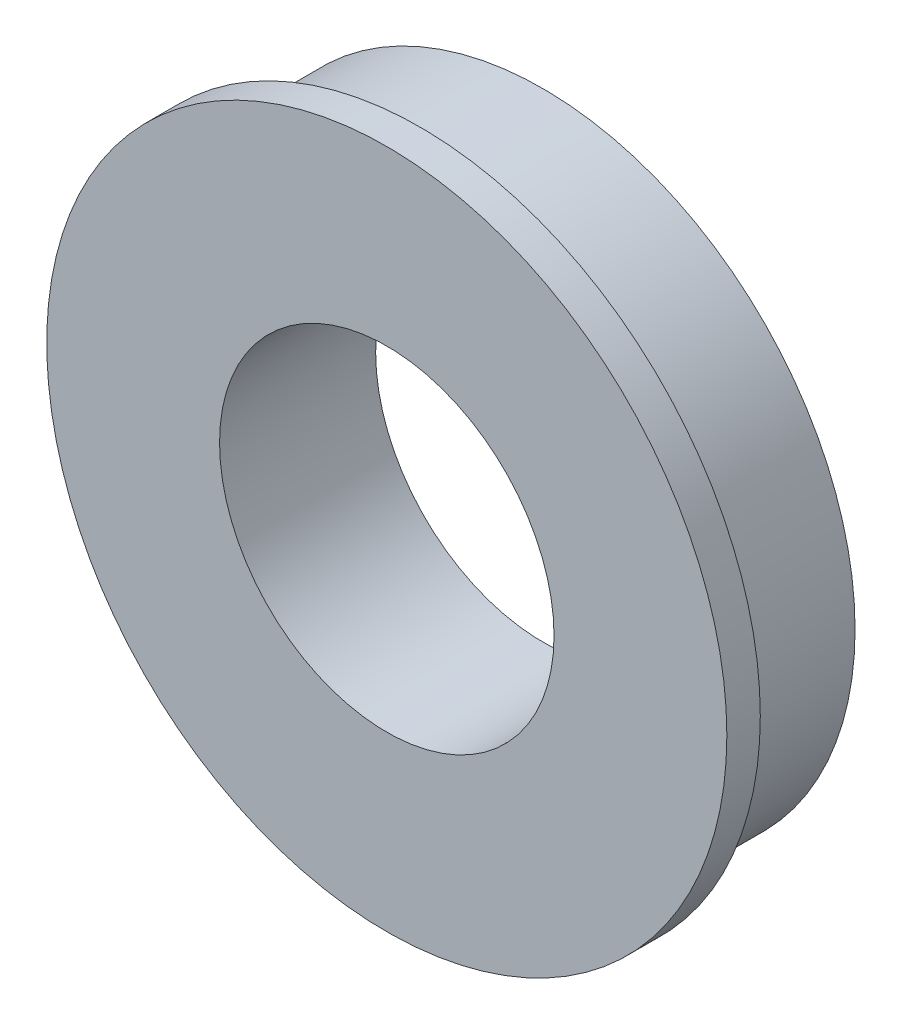
ISO-10303-21;
HEADER;
FILE_DESCRIPTION(('STEP AP214'),'2;1');
FILE_NAME('part.step','',(''),(''),'','','');
FILE_SCHEMA(('AUTOMOTIVE_DESIGN { 1 0 10303 214 1 1 1 1 }'));
ENDSEC;
DATA;
#1=APPLICATION_CONTEXT('core data for automotive mechanical design processes');
#2=APPLICATION_PROTOCOL_DEFINITION('international standard','automotive_design',2000,#1);
#3=PRODUCT_CONTEXT('',#1,'mechanical');
#4=PRODUCT('Part','Part','',(#3));
#5=PRODUCT_RELATED_PRODUCT_CATEGORY('part','',(#4));
#6=PRODUCT_DEFINITION_FORMATION('','',#4);
#7=PRODUCT_DEFINITION_CONTEXT('part definition',#1,'design');
#8=PRODUCT_DEFINITION('design','',#6,#7);
#9=PRODUCT_DEFINITION_SHAPE('','',#8);
#10=(LENGTH_UNIT() NAMED_UNIT(*) SI_UNIT(.MILLI.,.METRE.));
#11=(NAMED_UNIT(*) PLANE_ANGLE_UNIT() SI_UNIT($,.RADIAN.));
#12=(NAMED_UNIT(*) SI_UNIT($,.STERADIAN.) SOLID_ANGLE_UNIT());
#13=UNCERTAINTY_MEASURE_WITH_UNIT(LENGTH_MEASURE(1.E-05),#10,'distance_accuracy_value','');
#14=(GEOMETRIC_REPRESENTATION_CONTEXT(3) GLOBAL_UNCERTAINTY_ASSIGNED_CONTEXT((#13)) GLOBAL_UNIT_ASSIGNED_CONTEXT((#10,
#11,#12)) REPRESENTATION_CONTEXT('',''));
#15=CARTESIAN_POINT('',(0.,0.,0.));
#16=DIRECTION('',(0.,0.,1.));
#17=DIRECTION('',(1.,0.,0.));
#18=AXIS2_PLACEMENT_3D('',#15,#16,#17);
#19=CARTESIAN_POINT('',(0.,0.,5.5));
#20=DIRECTION('',(0.,0.,-1.));
#21=DIRECTION('',(-1.,0.,0.));
#22=AXIS2_PLACEMENT_3D('',#19,#20,#21);
#23=CYLINDRICAL_SURFACE('',#22,14.);
#24=CARTESIAN_POINT('',(0.,0.,5.5));
#25=DIRECTION('',(0.,0.,1.));
#26=DIRECTION('',(1.,0.,0.));
#27=AXIS2_PLACEMENT_3D('',#24,#25,#26);
#28=CIRCLE('',#27,14.);
#29=CARTESIAN_POINT('',(14.,0.,5.5));
#30=VERTEX_POINT('',#29);
#31=EDGE_CURVE('E10',#30,#30,#28,.T.);
#32=ORIENTED_EDGE('',*,*,#31,.F.);
#33=EDGE_LOOP('',(#32));
#34=FACE_BOUND('',#33,.T.);
#35=CARTESIAN_POINT('',(0.,0.,0.));
#36=DIRECTION('',(0.,0.,1.));
#37=DIRECTION('',(1.,0.,0.));
#38=AXIS2_PLACEMENT_3D('',#35,#36,#37);
#39=CIRCLE('',#38,14.);
#40=CARTESIAN_POINT('',(14.,0.,0.));
#41=VERTEX_POINT('',#40);
#42=EDGE_CURVE('E39',#41,#41,#39,.T.);
#43=ORIENTED_EDGE('',*,*,#42,.T.);
#44=EDGE_LOOP('',(#43));
#45=FACE_BOUND('',#44,.T.);
#46=ADVANCED_FACE('F36',(#34,#45),#23,.T.);
#47=CARTESIAN_POINT('',(0.,0.,0.));
#48=DIRECTION('',(0.,0.,1.));
#49=DIRECTION('',(1.,0.,0.));
#50=AXIS2_PLACEMENT_3D('',#47,#48,#49);
#51=PLANE('',#50);
#52=CARTESIAN_POINT('',(0.,0.,0.));
#53=DIRECTION('',(0.,0.,-1.));
#54=DIRECTION('',(-1.,0.,0.));
#55=AXIS2_PLACEMENT_3D('',#52,#53,#54);
#56=CIRCLE('',#55,7.5);
#57=CARTESIAN_POINT('',(-7.5,0.,0.));
#58=VERTEX_POINT('',#57);
#59=EDGE_CURVE('E56',#58,#58,#56,.T.);
#60=ORIENTED_EDGE('',*,*,#59,.F.);
#61=EDGE_LOOP('',(#60));
#62=FACE_BOUND('',#61,.T.);
#63=ORIENTED_EDGE('',*,*,#42,.F.);
#64=EDGE_LOOP('',(#63));
#65=FACE_BOUND('',#64,.T.);
#66=ADVANCED_FACE('F68',(#62,#65),#51,.F.);
#67=CARTESIAN_POINT('',(0.,0.,5.5));
#68=DIRECTION('',(0.,0.,1.));
#69=DIRECTION('',(1.,0.,0.));
#70=AXIS2_PLACEMENT_3D('',#67,#68,#69);
#71=PLANE('',#70);
#72=CARTESIAN_POINT('',(0.,0.,5.5));
#73=DIRECTION('',(0.,0.,1.));
#74=DIRECTION('',(1.,0.,0.));
#75=AXIS2_PLACEMENT_3D('',#72,#73,#74);
#76=CIRCLE('',#75,15.25);
#77=CARTESIAN_POINT('',(15.25,0.,5.5));
#78=VERTEX_POINT('',#77);
#79=EDGE_CURVE('E52',#78,#78,#76,.T.);
#80=ORIENTED_EDGE('',*,*,#79,.F.);
#81=EDGE_LOOP('',(#80));
#82=FACE_BOUND('',#81,.T.);
#83=ORIENTED_EDGE('',*,*,#31,.T.);
#84=EDGE_LOOP('',(#83));
#85=FACE_BOUND('',#84,.T.);
#86=ADVANCED_FACE('F71',(#82,#85),#71,.F.);
#87=CARTESIAN_POINT('',(0.,0.,7.));
#88=DIRECTION('',(0.,0.,-1.));
#89=DIRECTION('',(-1.,0.,0.));
#90=AXIS2_PLACEMENT_3D('',#87,#88,#89);
#91=CYLINDRICAL_SURFACE('',#90,15.25);
#92=CARTESIAN_POINT('',(0.,0.,7.));
#93=DIRECTION('',(0.,0.,1.));
#94=DIRECTION('',(1.,0.,0.));
#95=AXIS2_PLACEMENT_3D('',#92,#93,#94);
#96=CIRCLE('',#95,15.25);
#97=CARTESIAN_POINT('',(15.25,0.,7.));
#98=VERTEX_POINT('',#97);
#99=EDGE_CURVE('E50',#98,#98,#96,.T.);
#100=ORIENTED_EDGE('',*,*,#99,.F.);
#101=EDGE_LOOP('',(#100));
#102=FACE_BOUND('',#101,.T.);
#103=ORIENTED_EDGE('',*,*,#79,.T.);
#104=EDGE_LOOP('',(#103));
#105=FACE_BOUND('',#104,.T.);
#106=ADVANCED_FACE('F86',(#102,#105),#91,.T.);
#107=CARTESIAN_POINT('',(0.,0.,7.));
#108=DIRECTION('',(0.,0.,1.));
#109=DIRECTION('',(1.,0.,0.));
#110=AXIS2_PLACEMENT_3D('',#107,#108,#109);
#111=PLANE('',#110);
#112=CARTESIAN_POINT('',(0.,0.,7.));
#113=DIRECTION('',(0.,0.,1.));
#114=DIRECTION('',(1.,0.,0.));
#115=AXIS2_PLACEMENT_3D('',#112,#113,#114);
#116=CIRCLE('',#115,7.5);
#117=CARTESIAN_POINT('',(7.5,0.,7.));
#118=VERTEX_POINT('',#117);
#119=EDGE_CURVE('E59',#118,#118,#116,.F.);
#120=ORIENTED_EDGE('',*,*,#119,.T.);
#121=EDGE_LOOP('',(#120));
#122=FACE_BOUND('',#121,.T.);
#123=ORIENTED_EDGE('',*,*,#99,.T.);
#124=EDGE_LOOP('',(#123));
#125=FACE_BOUND('',#124,.T.);
#126=ADVANCED_FACE('F93',(#122,#125),#111,.T.);
#127=CARTESIAN_POINT('',(0.,0.,7.001));
#128=DIRECTION('',(0.,0.,-1.));
#129=DIRECTION('',(-1.,0.,0.));
#130=AXIS2_PLACEMENT_3D('',#127,#128,#129);
#131=CYLINDRICAL_SURFACE('',#130,7.5);
#132=ORIENTED_EDGE('',*,*,#119,.F.);
#133=EDGE_LOOP('',(#132));
#134=FACE_BOUND('',#133,.T.);
#135=ORIENTED_EDGE('',*,*,#59,.T.);
#136=EDGE_LOOP('',(#135));
#137=FACE_BOUND('',#136,.T.);
#138=ADVANCED_FACE('F66',(#134,#137),#131,.F.);
#139=CLOSED_SHELL('',(#46,#66,#86,#106,#126,#138));
#140=MANIFOLD_SOLID_BREP('B2',#139);
#141=ADVANCED_BREP_SHAPE_REPRESENTATION('',(#18,#140),#14);
#142=SHAPE_DEFINITION_REPRESENTATION(#9,#141);
ENDSEC;
END-ISO-10303-21;
